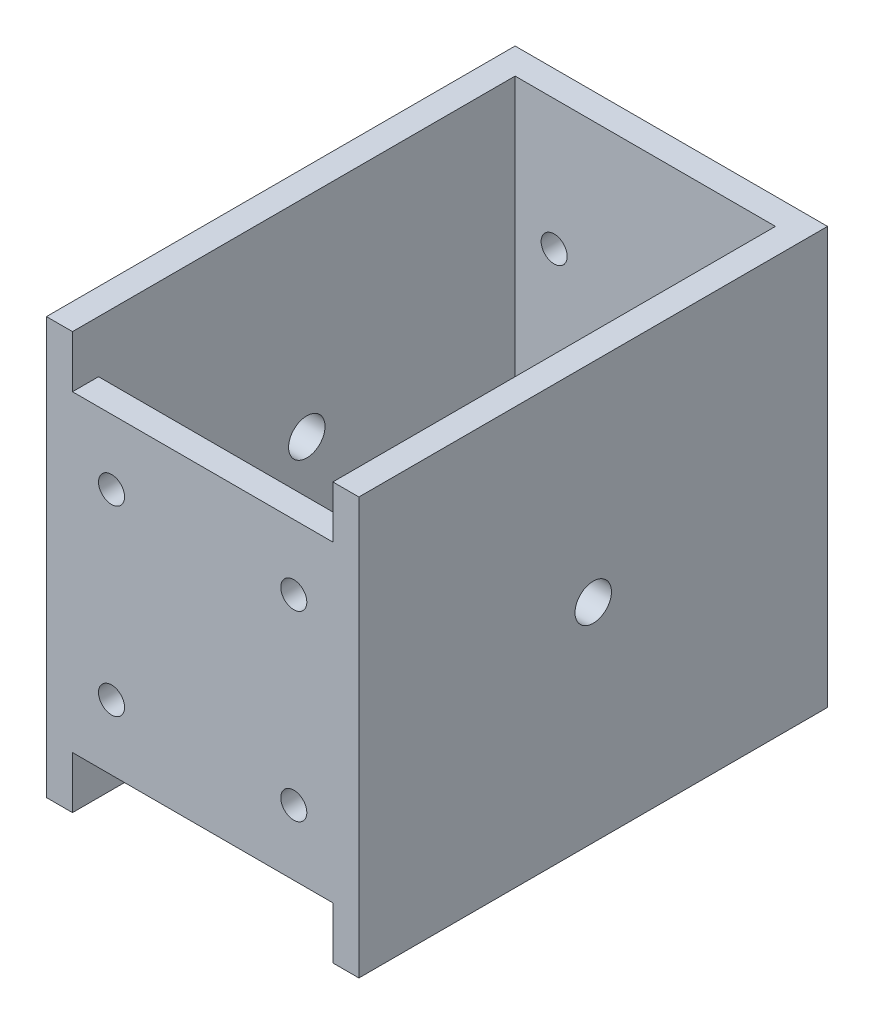
ISO-10303-21;
HEADER;
FILE_DESCRIPTION(('STEP AP214'),'2;1');
FILE_NAME('part.step','',(''),(''),'','','');
FILE_SCHEMA(('AUTOMOTIVE_DESIGN { 1 0 10303 214 1 1 1 1 }'));
ENDSEC;
DATA;
#1=APPLICATION_CONTEXT('core data for automotive mechanical design processes');
#2=APPLICATION_PROTOCOL_DEFINITION('international standard','automotive_design',2000,#1);
#3=PRODUCT_CONTEXT('',#1,'mechanical');
#4=PRODUCT('Part','Part','',(#3));
#5=PRODUCT_RELATED_PRODUCT_CATEGORY('part','',(#4));
#6=PRODUCT_DEFINITION_FORMATION('','',#4);
#7=PRODUCT_DEFINITION_CONTEXT('part definition',#1,'design');
#8=PRODUCT_DEFINITION('design','',#6,#7);
#9=PRODUCT_DEFINITION_SHAPE('','',#8);
#10=(LENGTH_UNIT() NAMED_UNIT(*) SI_UNIT(.MILLI.,.METRE.));
#11=(NAMED_UNIT(*) PLANE_ANGLE_UNIT() SI_UNIT($,.RADIAN.));
#12=(NAMED_UNIT(*) SI_UNIT($,.STERADIAN.) SOLID_ANGLE_UNIT());
#13=UNCERTAINTY_MEASURE_WITH_UNIT(LENGTH_MEASURE(1.E-05),#10,'distance_accuracy_value','');
#14=(GEOMETRIC_REPRESENTATION_CONTEXT(3) GLOBAL_UNCERTAINTY_ASSIGNED_CONTEXT((#13)) GLOBAL_UNIT_ASSIGNED_CONTEXT((#10,
#11,#12)) REPRESENTATION_CONTEXT('',''));
#15=CARTESIAN_POINT('',(0.,0.,0.));
#16=DIRECTION('',(0.,0.,1.));
#17=DIRECTION('',(1.,0.,0.));
#18=AXIS2_PLACEMENT_3D('',#15,#16,#17);
#19=CARTESIAN_POINT('',(30.,40.,80.));
#20=DIRECTION('',(-1.,0.,0.));
#21=DIRECTION('',(0.,-1.,0.));
#22=AXIS2_PLACEMENT_3D('',#19,#20,#21);
#23=PLANE('',#22);
#24=CARTESIAN_POINT('',(30.,0.,45.));
#25=DIRECTION('',(1.,0.,0.));
#26=DIRECTION('',(0.,1.,0.));
#27=AXIS2_PLACEMENT_3D('',#24,#25,#26);
#28=CIRCLE('',#27,3.5);
#29=CARTESIAN_POINT('',(30.,3.5,45.));
#30=VERTEX_POINT('',#29);
#31=EDGE_CURVE('E159',#30,#30,#28,.T.);
#32=ORIENTED_EDGE('',*,*,#31,.F.);
#33=EDGE_LOOP('',(#32));
#34=FACE_BOUND('',#33,.T.);
#35=DIRECTION('',(0.,1.,0.));
#36=VECTOR('',#35,1.);
#37=CARTESIAN_POINT('',(30.,40.,0.));
#38=LINE('',#37,#36);
#39=CARTESIAN_POINT('',(30.,-40.,0.));
#40=VERTEX_POINT('',#39);
#41=CARTESIAN_POINT('',(30.,40.,0.));
#42=VERTEX_POINT('',#41);
#43=EDGE_CURVE('E220',#40,#42,#38,.T.);
#44=ORIENTED_EDGE('',*,*,#43,.T.);
#45=DIRECTION('',(0.,0.,-1.));
#46=VECTOR('',#45,1.);
#47=CARTESIAN_POINT('',(30.,40.,80.));
#48=LINE('',#47,#46);
#49=CARTESIAN_POINT('',(30.,40.,90.));
#50=VERTEX_POINT('',#49);
#51=EDGE_CURVE('E11',#50,#42,#48,.T.);
#52=ORIENTED_EDGE('',*,*,#51,.F.);
#53=DIRECTION('',(0.,1.,0.));
#54=VECTOR('',#53,1.);
#55=CARTESIAN_POINT('',(30.,40.,90.));
#56=LINE('',#55,#54);
#57=CARTESIAN_POINT('',(30.,-40.,90.));
#58=VERTEX_POINT('',#57);
#59=EDGE_CURVE('E309',#58,#50,#56,.T.);
#60=ORIENTED_EDGE('',*,*,#59,.F.);
#61=DIRECTION('',(0.,0.,-1.));
#62=VECTOR('',#61,1.);
#63=CARTESIAN_POINT('',(30.,-40.,80.));
#64=LINE('',#63,#62);
#65=EDGE_CURVE('E235',#58,#40,#64,.T.);
#66=ORIENTED_EDGE('',*,*,#65,.T.);
#67=EDGE_LOOP('',(#44,#52,#60,#66));
#68=FACE_BOUND('',#67,.T.);
#69=ADVANCED_FACE('F43',(#34,#68),#23,.F.);
#70=CARTESIAN_POINT('',(-30.,40.,80.));
#71=DIRECTION('',(0.,-1.,0.));
#72=DIRECTION('',(0.,0.,-1.));
#73=AXIS2_PLACEMENT_3D('',#70,#71,#72);
#74=PLANE('',#73);
#75=DIRECTION('',(-1.,0.,0.));
#76=VECTOR('',#75,1.);
#77=CARTESIAN_POINT('',(-30.,40.,90.));
#78=LINE('',#77,#76);
#79=CARTESIAN_POINT('',(-25.,40.,90.));
#80=VERTEX_POINT('',#79);
#81=CARTESIAN_POINT('',(-30.,40.,90.));
#82=VERTEX_POINT('',#81);
#83=EDGE_CURVE('E307',#80,#82,#78,.T.);
#84=ORIENTED_EDGE('',*,*,#83,.F.);
#85=DIRECTION('',(0.,0.,1.));
#86=VECTOR('',#85,1.);
#87=CARTESIAN_POINT('',(-25.,40.,80.));
#88=LINE('',#87,#86);
#89=CARTESIAN_POINT('',(-25.,40.,5.));
#90=VERTEX_POINT('',#89);
#91=EDGE_CURVE('E198',#90,#80,#88,.T.);
#92=ORIENTED_EDGE('',*,*,#91,.F.);
#93=DIRECTION('',(-1.,0.,0.));
#94=VECTOR('',#93,1.);
#95=CARTESIAN_POINT('',(-25.,40.,5.));
#96=LINE('',#95,#94);
#97=CARTESIAN_POINT('',(25.,40.,5.));
#98=VERTEX_POINT('',#97);
#99=EDGE_CURVE('E210',#98,#90,#96,.T.);
#100=ORIENTED_EDGE('',*,*,#99,.F.);
#101=DIRECTION('',(0.,0.,-1.));
#102=VECTOR('',#101,1.);
#103=CARTESIAN_POINT('',(25.,40.,5.));
#104=LINE('',#103,#102);
#105=CARTESIAN_POINT('',(25.,40.,90.));
#106=VERTEX_POINT('',#105);
#107=EDGE_CURVE('E206',#106,#98,#104,.T.);
#108=ORIENTED_EDGE('',*,*,#107,.F.);
#109=EDGE_CURVE('E166',#50,#106,#78,.T.);
#110=ORIENTED_EDGE('',*,*,#109,.F.);
#111=ORIENTED_EDGE('',*,*,#51,.T.);
#112=DIRECTION('',(-1.,0.,0.));
#113=VECTOR('',#112,1.);
#114=CARTESIAN_POINT('',(-30.,40.,0.));
#115=LINE('',#114,#113);
#116=CARTESIAN_POINT('',(-30.,40.,0.));
#117=VERTEX_POINT('',#116);
#118=EDGE_CURVE('E226',#42,#117,#115,.T.);
#119=ORIENTED_EDGE('',*,*,#118,.T.);
#120=DIRECTION('',(0.,0.,-1.));
#121=VECTOR('',#120,1.);
#122=CARTESIAN_POINT('',(-30.,40.,80.));
#123=LINE('',#122,#121);
#124=EDGE_CURVE('E52',#82,#117,#123,.T.);
#125=ORIENTED_EDGE('',*,*,#124,.F.);
#126=EDGE_LOOP('',(#84,#92,#100,#108,#110,#111,#119,#125));
#127=FACE_BOUND('',#126,.T.);
#128=ADVANCED_FACE('F281',(#127),#74,.F.);
#129=CARTESIAN_POINT('',(-30.,40.,80.));
#130=DIRECTION('',(1.,0.,0.));
#131=DIRECTION('',(0.,1.,0.));
#132=AXIS2_PLACEMENT_3D('',#129,#130,#131);
#133=PLANE('',#132);
#134=CARTESIAN_POINT('',(-30.,0.,45.));
#135=DIRECTION('',(1.,0.,0.));
#136=DIRECTION('',(0.,1.,0.));
#137=AXIS2_PLACEMENT_3D('',#134,#135,#136);
#138=CIRCLE('',#137,3.5);
#139=CARTESIAN_POINT('',(-30.,3.49999999999999,45.));
#140=VERTEX_POINT('',#139);
#141=EDGE_CURVE('E174',#140,#140,#138,.T.);
#142=ORIENTED_EDGE('',*,*,#141,.T.);
#143=EDGE_LOOP('',(#142));
#144=FACE_BOUND('',#143,.T.);
#145=DIRECTION('',(0.,-1.,0.));
#146=VECTOR('',#145,1.);
#147=CARTESIAN_POINT('',(-30.,40.,0.));
#148=LINE('',#147,#146);
#149=CARTESIAN_POINT('',(-30.,-40.,0.));
#150=VERTEX_POINT('',#149);
#151=EDGE_CURVE('E229',#117,#150,#148,.T.);
#152=ORIENTED_EDGE('',*,*,#151,.T.);
#153=DIRECTION('',(0.,0.,-1.));
#154=VECTOR('',#153,1.);
#155=CARTESIAN_POINT('',(-30.,-40.,80.));
#156=LINE('',#155,#154);
#157=CARTESIAN_POINT('',(-30.,-40.,90.));
#158=VERTEX_POINT('',#157);
#159=EDGE_CURVE('E239',#158,#150,#156,.T.);
#160=ORIENTED_EDGE('',*,*,#159,.F.);
#161=DIRECTION('',(0.,-1.,0.));
#162=VECTOR('',#161,1.);
#163=CARTESIAN_POINT('',(-30.,-40.,90.));
#164=LINE('',#163,#162);
#165=EDGE_CURVE('E318',#82,#158,#164,.T.);
#166=ORIENTED_EDGE('',*,*,#165,.F.);
#167=ORIENTED_EDGE('',*,*,#124,.T.);
#168=EDGE_LOOP('',(#152,#160,#166,#167));
#169=FACE_BOUND('',#168,.T.);
#170=ADVANCED_FACE('F286',(#144,#169),#133,.F.);
#171=CARTESIAN_POINT('',(-30.,-40.,80.));
#172=DIRECTION('',(0.,1.,0.));
#173=DIRECTION('',(0.,0.,1.));
#174=AXIS2_PLACEMENT_3D('',#171,#172,#173);
#175=PLANE('',#174);
#176=DIRECTION('',(0.,0.,1.));
#177=VECTOR('',#176,1.);
#178=CARTESIAN_POINT('',(-25.,-40.,80.));
#179=LINE('',#178,#177);
#180=CARTESIAN_POINT('',(-25.,-40.,5.));
#181=VERTEX_POINT('',#180);
#182=CARTESIAN_POINT('',(-25.,-40.,90.));
#183=VERTEX_POINT('',#182);
#184=EDGE_CURVE('E202',#181,#183,#179,.T.);
#185=ORIENTED_EDGE('',*,*,#184,.T.);
#186=DIRECTION('',(1.,0.,0.));
#187=VECTOR('',#186,1.);
#188=CARTESIAN_POINT('',(30.,-40.,90.));
#189=LINE('',#188,#187);
#190=EDGE_CURVE('E313',#158,#183,#189,.T.);
#191=ORIENTED_EDGE('',*,*,#190,.F.);
#192=ORIENTED_EDGE('',*,*,#159,.T.);
#193=DIRECTION('',(1.,0.,0.));
#194=VECTOR('',#193,1.);
#195=CARTESIAN_POINT('',(-30.,-40.,0.));
#196=LINE('',#195,#194);
#197=EDGE_CURVE('E232',#150,#40,#196,.T.);
#198=ORIENTED_EDGE('',*,*,#197,.T.);
#199=ORIENTED_EDGE('',*,*,#65,.F.);
#200=CARTESIAN_POINT('',(25.,-40.,90.));
#201=VERTEX_POINT('',#200);
#202=EDGE_CURVE('E317',#201,#58,#189,.T.);
#203=ORIENTED_EDGE('',*,*,#202,.F.);
#204=DIRECTION('',(0.,0.,-1.));
#205=VECTOR('',#204,1.);
#206=CARTESIAN_POINT('',(25.,-40.,5.));
#207=LINE('',#206,#205);
#208=CARTESIAN_POINT('',(25.,-40.,5.));
#209=VERTEX_POINT('',#208);
#210=EDGE_CURVE('E68',#201,#209,#207,.T.);
#211=ORIENTED_EDGE('',*,*,#210,.T.);
#212=DIRECTION('',(-1.,0.,0.));
#213=VECTOR('',#212,1.);
#214=CARTESIAN_POINT('',(-25.,-40.,5.));
#215=LINE('',#214,#213);
#216=EDGE_CURVE('E197',#209,#181,#215,.T.);
#217=ORIENTED_EDGE('',*,*,#216,.T.);
#218=EDGE_LOOP('',(#185,#191,#192,#198,#199,#203,#211,#217));
#219=FACE_BOUND('',#218,.T.);
#220=ADVANCED_FACE('F386',(#219),#175,.F.);
#221=CARTESIAN_POINT('',(0.,0.,0.));
#222=DIRECTION('',(0.,0.,1.));
#223=DIRECTION('',(1.,0.,0.));
#224=AXIS2_PLACEMENT_3D('',#221,#222,#223);
#225=PLANE('',#224);
#226=CARTESIAN_POINT('',(-17.5,15.,0.));
#227=DIRECTION('',(0.,0.,-1.));
#228=DIRECTION('',(-1.,0.,0.));
#229=AXIS2_PLACEMENT_3D('',#226,#227,#228);
#230=CIRCLE('',#229,2.5);
#231=CARTESIAN_POINT('',(-20.,15.,0.));
#232=VERTEX_POINT('',#231);
#233=EDGE_CURVE('E183',#232,#232,#230,.T.);
#234=ORIENTED_EDGE('',*,*,#233,.F.);
#235=EDGE_LOOP('',(#234));
#236=FACE_BOUND('',#235,.T.);
#237=CARTESIAN_POINT('',(17.5,-20.,0.));
#238=DIRECTION('',(0.,0.,-1.));
#239=DIRECTION('',(-1.,0.,0.));
#240=AXIS2_PLACEMENT_3D('',#237,#238,#239);
#241=CIRCLE('',#240,2.5);
#242=CARTESIAN_POINT('',(15.,-20.,0.));
#243=VERTEX_POINT('',#242);
#244=EDGE_CURVE('E182',#243,#243,#241,.T.);
#245=ORIENTED_EDGE('',*,*,#244,.F.);
#246=EDGE_LOOP('',(#245));
#247=FACE_BOUND('',#246,.T.);
#248=CARTESIAN_POINT('',(-17.5,-20.,0.));
#249=DIRECTION('',(0.,0.,-1.));
#250=DIRECTION('',(-1.,0.,0.));
#251=AXIS2_PLACEMENT_3D('',#248,#249,#250);
#252=CIRCLE('',#251,2.5);
#253=CARTESIAN_POINT('',(-20.,-20.,0.));
#254=VERTEX_POINT('',#253);
#255=EDGE_CURVE('E178',#254,#254,#252,.T.);
#256=ORIENTED_EDGE('',*,*,#255,.F.);
#257=EDGE_LOOP('',(#256));
#258=FACE_BOUND('',#257,.T.);
#259=CARTESIAN_POINT('',(17.5,15.,0.));
#260=DIRECTION('',(0.,0.,-1.));
#261=DIRECTION('',(-1.,0.,0.));
#262=AXIS2_PLACEMENT_3D('',#259,#260,#261);
#263=CIRCLE('',#262,2.5);
#264=CARTESIAN_POINT('',(15.,15.,0.));
#265=VERTEX_POINT('',#264);
#266=EDGE_CURVE('E187',#265,#265,#263,.T.);
#267=ORIENTED_EDGE('',*,*,#266,.F.);
#268=EDGE_LOOP('',(#267));
#269=FACE_BOUND('',#268,.T.);
#270=ORIENTED_EDGE('',*,*,#43,.F.);
#271=ORIENTED_EDGE('',*,*,#197,.F.);
#272=ORIENTED_EDGE('',*,*,#151,.F.);
#273=ORIENTED_EDGE('',*,*,#118,.F.);
#274=EDGE_LOOP('',(#270,#271,#272,#273));
#275=FACE_BOUND('',#274,.T.);
#276=ADVANCED_FACE('F296',(#236,#247,#258,#269,#275),#225,.F.);
#277=CARTESIAN_POINT('',(-25.,-40.,80.));
#278=DIRECTION('',(-1.,0.,0.));
#279=DIRECTION('',(0.,0.,1.));
#280=AXIS2_PLACEMENT_3D('',#277,#278,#279);
#281=PLANE('',#280);
#282=CARTESIAN_POINT('',(-25.,0.,45.));
#283=DIRECTION('',(-1.,0.,0.));
#284=DIRECTION('',(0.,0.,1.));
#285=AXIS2_PLACEMENT_3D('',#282,#283,#284);
#286=CIRCLE('',#285,3.5);
#287=CARTESIAN_POINT('',(-25.,0.,48.5));
#288=VERTEX_POINT('',#287);
#289=EDGE_CURVE('E170',#288,#288,#286,.T.);
#290=ORIENTED_EDGE('',*,*,#289,.T.);
#291=EDGE_LOOP('',(#290));
#292=FACE_BOUND('',#291,.T.);
#293=ORIENTED_EDGE('',*,*,#91,.T.);
#294=DIRECTION('',(0.,-1.,0.));
#295=VECTOR('',#294,1.);
#296=CARTESIAN_POINT('',(-25.,30.,90.));
#297=LINE('',#296,#295);
#298=CARTESIAN_POINT('',(-25.,30.,90.));
#299=VERTEX_POINT('',#298);
#300=EDGE_CURVE('E60',#80,#299,#297,.T.);
#301=ORIENTED_EDGE('',*,*,#300,.T.);
#302=DIRECTION('',(0.,0.,1.));
#303=VECTOR('',#302,1.);
#304=CARTESIAN_POINT('',(-25.,30.,85.));
#305=LINE('',#304,#303);
#306=CARTESIAN_POINT('',(-25.,30.,85.));
#307=VERTEX_POINT('',#306);
#308=EDGE_CURVE('E133',#307,#299,#305,.T.);
#309=ORIENTED_EDGE('',*,*,#308,.F.);
#310=DIRECTION('',(0.,1.,0.));
#311=VECTOR('',#310,1.);
#312=CARTESIAN_POINT('',(-25.,40.,85.));
#313=LINE('',#312,#311);
#314=CARTESIAN_POINT('',(-25.,-30.,85.));
#315=VERTEX_POINT('',#314);
#316=EDGE_CURVE('E137',#315,#307,#313,.T.);
#317=ORIENTED_EDGE('',*,*,#316,.F.);
#318=DIRECTION('',(0.,0.,1.));
#319=VECTOR('',#318,1.);
#320=CARTESIAN_POINT('',(-25.,-30.,85.));
#321=LINE('',#320,#319);
#322=CARTESIAN_POINT('',(-25.,-30.,90.));
#323=VERTEX_POINT('',#322);
#324=EDGE_CURVE('E368',#315,#323,#321,.T.);
#325=ORIENTED_EDGE('',*,*,#324,.T.);
#326=DIRECTION('',(0.,-1.,0.));
#327=VECTOR('',#326,1.);
#328=CARTESIAN_POINT('',(-25.,-40.,90.));
#329=LINE('',#328,#327);
#330=EDGE_CURVE('E356',#323,#183,#329,.T.);
#331=ORIENTED_EDGE('',*,*,#330,.T.);
#332=ORIENTED_EDGE('',*,*,#184,.F.);
#333=DIRECTION('',(0.,1.,0.));
#334=VECTOR('',#333,1.);
#335=CARTESIAN_POINT('',(-25.,-40.,5.));
#336=LINE('',#335,#334);
#337=EDGE_CURVE('E217',#181,#90,#336,.T.);
#338=ORIENTED_EDGE('',*,*,#337,.T.);
#339=EDGE_LOOP('',(#293,#301,#309,#317,#325,#331,#332,#338));
#340=FACE_BOUND('',#339,.T.);
#341=ADVANCED_FACE('F135',(#292,#340),#281,.F.);
#342=CARTESIAN_POINT('',(-25.,-40.,5.));
#343=DIRECTION('',(0.,0.,-1.));
#344=DIRECTION('',(-1.,0.,0.));
#345=AXIS2_PLACEMENT_3D('',#342,#343,#344);
#346=PLANE('',#345);
#347=CARTESIAN_POINT('',(-17.5,15.,5.));
#348=DIRECTION('',(0.,0.,-1.));
#349=DIRECTION('',(-1.,0.,0.));
#350=AXIS2_PLACEMENT_3D('',#347,#348,#349);
#351=CIRCLE('',#350,2.5);
#352=CARTESIAN_POINT('',(-20.,15.,5.));
#353=VERTEX_POINT('',#352);
#354=EDGE_CURVE('E211',#353,#353,#351,.T.);
#355=ORIENTED_EDGE('',*,*,#354,.T.);
#356=EDGE_LOOP('',(#355));
#357=FACE_BOUND('',#356,.T.);
#358=CARTESIAN_POINT('',(17.5,-20.,5.));
#359=DIRECTION('',(0.,0.,-1.));
#360=DIRECTION('',(-1.,0.,0.));
#361=AXIS2_PLACEMENT_3D('',#358,#359,#360);
#362=CIRCLE('',#361,2.5);
#363=CARTESIAN_POINT('',(15.,-20.,5.));
#364=VERTEX_POINT('',#363);
#365=EDGE_CURVE('E253',#364,#364,#362,.T.);
#366=ORIENTED_EDGE('',*,*,#365,.T.);
#367=EDGE_LOOP('',(#366));
#368=FACE_BOUND('',#367,.T.);
#369=CARTESIAN_POINT('',(-17.5,-20.,5.));
#370=DIRECTION('',(0.,0.,-1.));
#371=DIRECTION('',(-1.,0.,0.));
#372=AXIS2_PLACEMENT_3D('',#369,#370,#371);
#373=CIRCLE('',#372,2.5);
#374=CARTESIAN_POINT('',(-20.,-20.,5.));
#375=VERTEX_POINT('',#374);
#376=EDGE_CURVE('E249',#375,#375,#373,.T.);
#377=ORIENTED_EDGE('',*,*,#376,.T.);
#378=EDGE_LOOP('',(#377));
#379=FACE_BOUND('',#378,.T.);
#380=CARTESIAN_POINT('',(17.5,15.,5.));
#381=DIRECTION('',(0.,0.,-1.));
#382=DIRECTION('',(-1.,0.,0.));
#383=AXIS2_PLACEMENT_3D('',#380,#381,#382);
#384=CIRCLE('',#383,2.5);
#385=CARTESIAN_POINT('',(15.,15.,5.));
#386=VERTEX_POINT('',#385);
#387=EDGE_CURVE('E194',#386,#386,#384,.T.);
#388=ORIENTED_EDGE('',*,*,#387,.T.);
#389=EDGE_LOOP('',(#388));
#390=FACE_BOUND('',#389,.T.);
#391=ORIENTED_EDGE('',*,*,#99,.T.);
#392=ORIENTED_EDGE('',*,*,#337,.F.);
#393=ORIENTED_EDGE('',*,*,#216,.F.);
#394=DIRECTION('',(0.,1.,0.));
#395=VECTOR('',#394,1.);
#396=CARTESIAN_POINT('',(25.,-40.,5.));
#397=LINE('',#396,#395);
#398=EDGE_CURVE('E205',#209,#98,#397,.T.);
#399=ORIENTED_EDGE('',*,*,#398,.T.);
#400=EDGE_LOOP('',(#391,#392,#393,#399));
#401=FACE_BOUND('',#400,.T.);
#402=ADVANCED_FACE('F260',(#357,#368,#379,#390,#401),#346,.F.);
#403=CARTESIAN_POINT('',(25.,-40.,5.));
#404=DIRECTION('',(1.,0.,0.));
#405=DIRECTION('',(0.,0.,-1.));
#406=AXIS2_PLACEMENT_3D('',#403,#404,#405);
#407=PLANE('',#406);
#408=CARTESIAN_POINT('',(25.,0.,45.));
#409=DIRECTION('',(1.,0.,0.));
#410=DIRECTION('',(0.,0.,-1.));
#411=AXIS2_PLACEMENT_3D('',#408,#409,#410);
#412=CIRCLE('',#411,3.5);
#413=CARTESIAN_POINT('',(25.,0.,41.5));
#414=VERTEX_POINT('',#413);
#415=EDGE_CURVE('E46',#414,#414,#412,.T.);
#416=ORIENTED_EDGE('',*,*,#415,.T.);
#417=EDGE_LOOP('',(#416));
#418=FACE_BOUND('',#417,.T.);
#419=ORIENTED_EDGE('',*,*,#107,.T.);
#420=ORIENTED_EDGE('',*,*,#398,.F.);
#421=ORIENTED_EDGE('',*,*,#210,.F.);
#422=DIRECTION('',(0.,1.,0.));
#423=VECTOR('',#422,1.);
#424=CARTESIAN_POINT('',(25.,-30.,90.));
#425=LINE('',#424,#423);
#426=CARTESIAN_POINT('',(25.,-30.,90.));
#427=VERTEX_POINT('',#426);
#428=EDGE_CURVE('E358',#201,#427,#425,.T.);
#429=ORIENTED_EDGE('',*,*,#428,.T.);
#430=DIRECTION('',(0.,0.,1.));
#431=VECTOR('',#430,1.);
#432=CARTESIAN_POINT('',(25.,-30.,85.));
#433=LINE('',#432,#431);
#434=CARTESIAN_POINT('',(25.,-30.,85.));
#435=VERTEX_POINT('',#434);
#436=EDGE_CURVE('E357',#435,#427,#433,.T.);
#437=ORIENTED_EDGE('',*,*,#436,.F.);
#438=DIRECTION('',(0.,-1.,0.));
#439=VECTOR('',#438,1.);
#440=CARTESIAN_POINT('',(25.,-40.,85.));
#441=LINE('',#440,#439);
#442=CARTESIAN_POINT('',(25.,30.,85.));
#443=VERTEX_POINT('',#442);
#444=EDGE_CURVE('E160',#443,#435,#441,.T.);
#445=ORIENTED_EDGE('',*,*,#444,.F.);
#446=DIRECTION('',(0.,0.,1.));
#447=VECTOR('',#446,1.);
#448=CARTESIAN_POINT('',(25.,30.,85.));
#449=LINE('',#448,#447);
#450=CARTESIAN_POINT('',(25.,30.,90.));
#451=VERTEX_POINT('',#450);
#452=EDGE_CURVE('E142',#443,#451,#449,.T.);
#453=ORIENTED_EDGE('',*,*,#452,.T.);
#454=DIRECTION('',(0.,1.,0.));
#455=VECTOR('',#454,1.);
#456=CARTESIAN_POINT('',(25.,40.,90.));
#457=LINE('',#456,#455);
#458=EDGE_CURVE('E151',#451,#106,#457,.T.);
#459=ORIENTED_EDGE('',*,*,#458,.T.);
#460=EDGE_LOOP('',(#419,#420,#421,#429,#437,#445,#453,#459));
#461=FACE_BOUND('',#460,.T.);
#462=ADVANCED_FACE('F391',(#418,#461),#407,.F.);
#463=CARTESIAN_POINT('',(17.5,15.,60.));
#464=DIRECTION('',(0.,0.,-1.));
#465=DIRECTION('',(-1.,0.,0.));
#466=AXIS2_PLACEMENT_3D('',#463,#464,#465);
#467=CYLINDRICAL_SURFACE('',#466,2.5);
#468=ORIENTED_EDGE('',*,*,#266,.T.);
#469=EDGE_LOOP('',(#468));
#470=FACE_BOUND('',#469,.T.);
#471=ORIENTED_EDGE('',*,*,#387,.F.);
#472=EDGE_LOOP('',(#471));
#473=FACE_BOUND('',#472,.T.);
#474=ADVANCED_FACE('F404',(#470,#473),#467,.F.);
#475=CARTESIAN_POINT('',(-17.5,-20.,60.));
#476=DIRECTION('',(0.,0.,-1.));
#477=DIRECTION('',(-1.,0.,0.));
#478=AXIS2_PLACEMENT_3D('',#475,#476,#477);
#479=CYLINDRICAL_SURFACE('',#478,2.5);
#480=ORIENTED_EDGE('',*,*,#255,.T.);
#481=EDGE_LOOP('',(#480));
#482=FACE_BOUND('',#481,.T.);
#483=ORIENTED_EDGE('',*,*,#376,.F.);
#484=EDGE_LOOP('',(#483));
#485=FACE_BOUND('',#484,.T.);
#486=ADVANCED_FACE('F276',(#482,#485),#479,.F.);
#487=CARTESIAN_POINT('',(17.5,-20.,60.));
#488=DIRECTION('',(0.,0.,-1.));
#489=DIRECTION('',(-1.,0.,0.));
#490=AXIS2_PLACEMENT_3D('',#487,#488,#489);
#491=CYLINDRICAL_SURFACE('',#490,2.5);
#492=ORIENTED_EDGE('',*,*,#244,.T.);
#493=EDGE_LOOP('',(#492));
#494=FACE_BOUND('',#493,.T.);
#495=ORIENTED_EDGE('',*,*,#365,.F.);
#496=EDGE_LOOP('',(#495));
#497=FACE_BOUND('',#496,.T.);
#498=ADVANCED_FACE('F266',(#494,#497),#491,.F.);
#499=CARTESIAN_POINT('',(-17.5,15.,60.));
#500=DIRECTION('',(0.,0.,-1.));
#501=DIRECTION('',(-1.,0.,0.));
#502=AXIS2_PLACEMENT_3D('',#499,#500,#501);
#503=CYLINDRICAL_SURFACE('',#502,2.5);
#504=ORIENTED_EDGE('',*,*,#233,.T.);
#505=EDGE_LOOP('',(#504));
#506=FACE_BOUND('',#505,.T.);
#507=ORIENTED_EDGE('',*,*,#354,.F.);
#508=EDGE_LOOP('',(#507));
#509=FACE_BOUND('',#508,.T.);
#510=ADVANCED_FACE('F263',(#506,#509),#503,.F.);
#511=CARTESIAN_POINT('',(-50.,0.,45.));
#512=DIRECTION('',(1.,0.,0.));
#513=DIRECTION('',(0.,1.,0.));
#514=AXIS2_PLACEMENT_3D('',#511,#512,#513);
#515=CYLINDRICAL_SURFACE('',#514,3.5);
#516=ORIENTED_EDGE('',*,*,#31,.T.);
#517=EDGE_LOOP('',(#516));
#518=FACE_BOUND('',#517,.T.);
#519=ORIENTED_EDGE('',*,*,#415,.F.);
#520=EDGE_LOOP('',(#519));
#521=FACE_BOUND('',#520,.T.);
#522=ADVANCED_FACE('F265',(#518,#521),#515,.F.);
#523=ORIENTED_EDGE('',*,*,#289,.F.);
#524=EDGE_LOOP('',(#523));
#525=FACE_BOUND('',#524,.T.);
#526=ORIENTED_EDGE('',*,*,#141,.F.);
#527=EDGE_LOOP('',(#526));
#528=FACE_BOUND('',#527,.T.);
#529=ADVANCED_FACE('F273',(#525,#528),#515,.F.);
#530=CARTESIAN_POINT('',(0.,0.,85.));
#531=DIRECTION('',(0.,0.,-1.));
#532=DIRECTION('',(-1.,0.,0.));
#533=AXIS2_PLACEMENT_3D('',#530,#531,#532);
#534=PLANE('',#533);
#535=DIRECTION('',(1.,0.,0.));
#536=VECTOR('',#535,1.);
#537=CARTESIAN_POINT('',(25.,30.,85.));
#538=LINE('',#537,#536);
#539=EDGE_CURVE('E143',#307,#443,#538,.T.);
#540=ORIENTED_EDGE('',*,*,#539,.T.);
#541=ORIENTED_EDGE('',*,*,#444,.T.);
#542=DIRECTION('',(-1.,0.,0.));
#543=VECTOR('',#542,1.);
#544=CARTESIAN_POINT('',(-25.,-30.,85.));
#545=LINE('',#544,#543);
#546=EDGE_CURVE('E157',#435,#315,#545,.T.);
#547=ORIENTED_EDGE('',*,*,#546,.T.);
#548=ORIENTED_EDGE('',*,*,#316,.T.);
#549=EDGE_LOOP('',(#540,#541,#547,#548));
#550=FACE_BOUND('',#549,.T.);
#551=CARTESIAN_POINT('',(-17.5,-17.5,85.));
#552=DIRECTION('',(0.,0.,1.));
#553=DIRECTION('',(1.,0.,0.));
#554=AXIS2_PLACEMENT_3D('',#551,#552,#553);
#555=CIRCLE('',#554,2.5);
#556=CARTESIAN_POINT('',(-15.,-17.5,85.));
#557=VERTEX_POINT('',#556);
#558=EDGE_CURVE('E331',#557,#557,#555,.T.);
#559=ORIENTED_EDGE('',*,*,#558,.T.);
#560=EDGE_LOOP('',(#559));
#561=FACE_BOUND('',#560,.T.);
#562=CARTESIAN_POINT('',(17.5,-17.5,85.));
#563=DIRECTION('',(0.,0.,1.));
#564=DIRECTION('',(1.,0.,0.));
#565=AXIS2_PLACEMENT_3D('',#562,#563,#564);
#566=CIRCLE('',#565,2.5);
#567=CARTESIAN_POINT('',(20.,-17.5,85.));
#568=VERTEX_POINT('',#567);
#569=EDGE_CURVE('E339',#568,#568,#566,.T.);
#570=ORIENTED_EDGE('',*,*,#569,.T.);
#571=EDGE_LOOP('',(#570));
#572=FACE_BOUND('',#571,.T.);
#573=CARTESIAN_POINT('',(17.5,17.5,85.));
#574=DIRECTION('',(0.,0.,1.));
#575=DIRECTION('',(1.,0.,0.));
#576=AXIS2_PLACEMENT_3D('',#573,#574,#575);
#577=CIRCLE('',#576,2.5);
#578=CARTESIAN_POINT('',(20.,17.5,85.));
#579=VERTEX_POINT('',#578);
#580=EDGE_CURVE('E347',#579,#579,#577,.T.);
#581=ORIENTED_EDGE('',*,*,#580,.T.);
#582=EDGE_LOOP('',(#581));
#583=FACE_BOUND('',#582,.T.);
#584=CARTESIAN_POINT('',(-17.5,17.5,85.));
#585=DIRECTION('',(0.,0.,1.));
#586=DIRECTION('',(1.,0.,0.));
#587=AXIS2_PLACEMENT_3D('',#584,#585,#586);
#588=CIRCLE('',#587,2.5);
#589=CARTESIAN_POINT('',(-15.,17.5,85.));
#590=VERTEX_POINT('',#589);
#591=EDGE_CURVE('E322',#590,#590,#588,.T.);
#592=ORIENTED_EDGE('',*,*,#591,.T.);
#593=EDGE_LOOP('',(#592));
#594=FACE_BOUND('',#593,.T.);
#595=ADVANCED_FACE('F154',(#550,#561,#572,#583,#594),#534,.T.);
#596=CARTESIAN_POINT('',(0.,0.,90.));
#597=DIRECTION('',(0.,0.,-1.));
#598=DIRECTION('',(-1.,0.,0.));
#599=AXIS2_PLACEMENT_3D('',#596,#597,#598);
#600=PLANE('',#599);
#601=CARTESIAN_POINT('',(-17.5,-17.5,90.));
#602=DIRECTION('',(0.,0.,1.));
#603=DIRECTION('',(1.,0.,0.));
#604=AXIS2_PLACEMENT_3D('',#601,#602,#603);
#605=CIRCLE('',#604,2.5);
#606=CARTESIAN_POINT('',(-15.,-17.5,90.));
#607=VERTEX_POINT('',#606);
#608=EDGE_CURVE('E335',#607,#607,#605,.T.);
#609=ORIENTED_EDGE('',*,*,#608,.F.);
#610=EDGE_LOOP('',(#609));
#611=FACE_BOUND('',#610,.T.);
#612=CARTESIAN_POINT('',(17.5,-17.5,90.));
#613=DIRECTION('',(0.,0.,1.));
#614=DIRECTION('',(1.,0.,0.));
#615=AXIS2_PLACEMENT_3D('',#612,#613,#614);
#616=CIRCLE('',#615,2.5);
#617=CARTESIAN_POINT('',(20.,-17.5,90.));
#618=VERTEX_POINT('',#617);
#619=EDGE_CURVE('E343',#618,#618,#616,.T.);
#620=ORIENTED_EDGE('',*,*,#619,.F.);
#621=EDGE_LOOP('',(#620));
#622=FACE_BOUND('',#621,.T.);
#623=CARTESIAN_POINT('',(17.5,17.5,90.));
#624=DIRECTION('',(0.,0.,1.));
#625=DIRECTION('',(1.,0.,0.));
#626=AXIS2_PLACEMENT_3D('',#623,#624,#625);
#627=CIRCLE('',#626,2.5);
#628=CARTESIAN_POINT('',(20.,17.5,90.));
#629=VERTEX_POINT('',#628);
#630=EDGE_CURVE('E327',#629,#629,#627,.T.);
#631=ORIENTED_EDGE('',*,*,#630,.F.);
#632=EDGE_LOOP('',(#631));
#633=FACE_BOUND('',#632,.T.);
#634=CARTESIAN_POINT('',(-17.5,17.5,90.));
#635=DIRECTION('',(0.,0.,1.));
#636=DIRECTION('',(1.,0.,0.));
#637=AXIS2_PLACEMENT_3D('',#634,#635,#636);
#638=CIRCLE('',#637,2.5);
#639=CARTESIAN_POINT('',(-15.,17.5,90.));
#640=VERTEX_POINT('',#639);
#641=EDGE_CURVE('E323',#640,#640,#638,.T.);
#642=ORIENTED_EDGE('',*,*,#641,.F.);
#643=EDGE_LOOP('',(#642));
#644=FACE_BOUND('',#643,.T.);
#645=DIRECTION('',(1.,0.,0.));
#646=VECTOR('',#645,1.);
#647=CARTESIAN_POINT('',(25.,30.,90.));
#648=LINE('',#647,#646);
#649=EDGE_CURVE('E377',#299,#451,#648,.T.);
#650=ORIENTED_EDGE('',*,*,#649,.F.);
#651=ORIENTED_EDGE('',*,*,#300,.F.);
#652=ORIENTED_EDGE('',*,*,#83,.T.);
#653=ORIENTED_EDGE('',*,*,#165,.T.);
#654=ORIENTED_EDGE('',*,*,#190,.T.);
#655=ORIENTED_EDGE('',*,*,#330,.F.);
#656=DIRECTION('',(-1.,0.,0.));
#657=VECTOR('',#656,1.);
#658=CARTESIAN_POINT('',(-25.,-30.,90.));
#659=LINE('',#658,#657);
#660=EDGE_CURVE('E361',#427,#323,#659,.T.);
#661=ORIENTED_EDGE('',*,*,#660,.F.);
#662=ORIENTED_EDGE('',*,*,#428,.F.);
#663=ORIENTED_EDGE('',*,*,#202,.T.);
#664=ORIENTED_EDGE('',*,*,#59,.T.);
#665=ORIENTED_EDGE('',*,*,#109,.T.);
#666=ORIENTED_EDGE('',*,*,#458,.F.);
#667=EDGE_LOOP('',(#650,#651,#652,#653,#654,#655,#661,#662,#663,#664,#665,#666));
#668=FACE_BOUND('',#667,.T.);
#669=ADVANCED_FACE('F383',(#611,#622,#633,#644,#668),#600,.F.);
#670=CARTESIAN_POINT('',(-17.5,17.5,85.));
#671=DIRECTION('',(0.,0.,1.));
#672=DIRECTION('',(1.,0.,0.));
#673=AXIS2_PLACEMENT_3D('',#670,#671,#672);
#674=CYLINDRICAL_SURFACE('',#673,2.5);
#675=ORIENTED_EDGE('',*,*,#591,.F.);
#676=EDGE_LOOP('',(#675));
#677=FACE_BOUND('',#676,.T.);
#678=ORIENTED_EDGE('',*,*,#641,.T.);
#679=EDGE_LOOP('',(#678));
#680=FACE_BOUND('',#679,.T.);
#681=ADVANCED_FACE('F475',(#677,#680),#674,.F.);
#682=CARTESIAN_POINT('',(17.5,17.5,85.));
#683=DIRECTION('',(0.,0.,1.));
#684=DIRECTION('',(1.,0.,0.));
#685=AXIS2_PLACEMENT_3D('',#682,#683,#684);
#686=CYLINDRICAL_SURFACE('',#685,2.5);
#687=ORIENTED_EDGE('',*,*,#580,.F.);
#688=EDGE_LOOP('',(#687));
#689=FACE_BOUND('',#688,.T.);
#690=ORIENTED_EDGE('',*,*,#630,.T.);
#691=EDGE_LOOP('',(#690));
#692=FACE_BOUND('',#691,.T.);
#693=ADVANCED_FACE('F518',(#689,#692),#686,.F.);
#694=CARTESIAN_POINT('',(17.5,-17.5,85.));
#695=DIRECTION('',(0.,0.,1.));
#696=DIRECTION('',(1.,0.,0.));
#697=AXIS2_PLACEMENT_3D('',#694,#695,#696);
#698=CYLINDRICAL_SURFACE('',#697,2.5);
#699=ORIENTED_EDGE('',*,*,#569,.F.);
#700=EDGE_LOOP('',(#699));
#701=FACE_BOUND('',#700,.T.);
#702=ORIENTED_EDGE('',*,*,#619,.T.);
#703=EDGE_LOOP('',(#702));
#704=FACE_BOUND('',#703,.T.);
#705=ADVANCED_FACE('F507',(#701,#704),#698,.F.);
#706=CARTESIAN_POINT('',(-17.5,-17.5,85.));
#707=DIRECTION('',(0.,0.,1.));
#708=DIRECTION('',(1.,0.,0.));
#709=AXIS2_PLACEMENT_3D('',#706,#707,#708);
#710=CYLINDRICAL_SURFACE('',#709,2.5);
#711=ORIENTED_EDGE('',*,*,#558,.F.);
#712=EDGE_LOOP('',(#711));
#713=FACE_BOUND('',#712,.T.);
#714=ORIENTED_EDGE('',*,*,#608,.T.);
#715=EDGE_LOOP('',(#714));
#716=FACE_BOUND('',#715,.T.);
#717=ADVANCED_FACE('F486',(#713,#716),#710,.F.);
#718=CARTESIAN_POINT('',(-25.,-30.,85.));
#719=DIRECTION('',(0.,1.,0.));
#720=DIRECTION('',(0.,0.,1.));
#721=AXIS2_PLACEMENT_3D('',#718,#719,#720);
#722=PLANE('',#721);
#723=ORIENTED_EDGE('',*,*,#660,.T.);
#724=ORIENTED_EDGE('',*,*,#324,.F.);
#725=ORIENTED_EDGE('',*,*,#546,.F.);
#726=ORIENTED_EDGE('',*,*,#436,.T.);
#727=EDGE_LOOP('',(#723,#724,#725,#726));
#728=FACE_BOUND('',#727,.T.);
#729=ADVANCED_FACE('F393',(#728),#722,.F.);
#730=CARTESIAN_POINT('',(25.,30.,85.));
#731=DIRECTION('',(0.,-1.,0.));
#732=DIRECTION('',(0.,0.,-1.));
#733=AXIS2_PLACEMENT_3D('',#730,#731,#732);
#734=PLANE('',#733);
#735=ORIENTED_EDGE('',*,*,#649,.T.);
#736=ORIENTED_EDGE('',*,*,#452,.F.);
#737=ORIENTED_EDGE('',*,*,#539,.F.);
#738=ORIENTED_EDGE('',*,*,#308,.T.);
#739=EDGE_LOOP('',(#735,#736,#737,#738));
#740=FACE_BOUND('',#739,.T.);
#741=ADVANCED_FACE('F146',(#740),#734,.F.);
#742=CLOSED_SHELL('',(#69,#128,#170,#220,#276,#341,#402,#462,#474,#486,#498,#510,#522,#529,#595,
#669,#681,#693,#705,#717,#729,#741));
#743=MANIFOLD_SOLID_BREP('B2',#742);
#744=ADVANCED_BREP_SHAPE_REPRESENTATION('',(#18,#743),#14);
#745=SHAPE_DEFINITION_REPRESENTATION(#9,#744);
ENDSEC;
END-ISO-10303-21;
